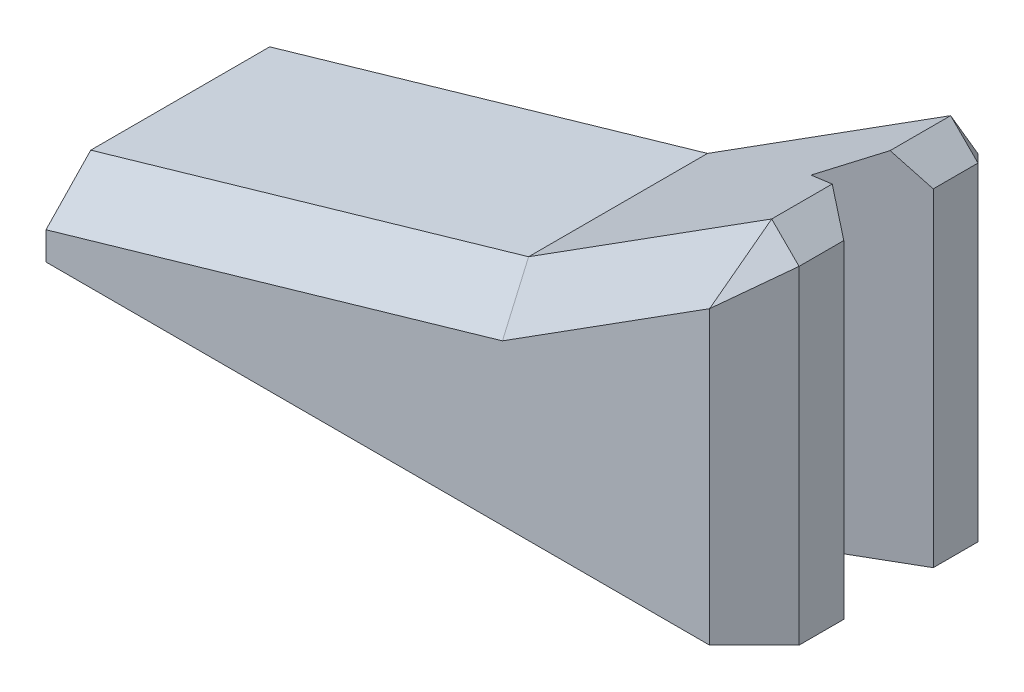
ISO-10303-21;
HEADER;
FILE_DESCRIPTION(('STEP AP214'),'2;1');
FILE_NAME('part.step','',(''),(''),'','','');
FILE_SCHEMA(('AUTOMOTIVE_DESIGN { 1 0 10303 214 1 1 1 1 }'));
ENDSEC;
DATA;
#1=APPLICATION_CONTEXT('core data for automotive mechanical design processes');
#2=APPLICATION_PROTOCOL_DEFINITION('international standard','automotive_design',2000,#1);
#3=PRODUCT_CONTEXT('',#1,'mechanical');
#4=PRODUCT('Part','Part','',(#3));
#5=PRODUCT_RELATED_PRODUCT_CATEGORY('part','',(#4));
#6=PRODUCT_DEFINITION_FORMATION('','',#4);
#7=PRODUCT_DEFINITION_CONTEXT('part definition',#1,'design');
#8=PRODUCT_DEFINITION('design','',#6,#7);
#9=PRODUCT_DEFINITION_SHAPE('','',#8);
#10=(LENGTH_UNIT() NAMED_UNIT(*) SI_UNIT(.MILLI.,.METRE.));
#11=(NAMED_UNIT(*) PLANE_ANGLE_UNIT() SI_UNIT($,.RADIAN.));
#12=(NAMED_UNIT(*) SI_UNIT($,.STERADIAN.) SOLID_ANGLE_UNIT());
#13=UNCERTAINTY_MEASURE_WITH_UNIT(LENGTH_MEASURE(1.E-05),#10,'distance_accuracy_value','');
#14=(GEOMETRIC_REPRESENTATION_CONTEXT(3) GLOBAL_UNCERTAINTY_ASSIGNED_CONTEXT((#13)) GLOBAL_UNIT_ASSIGNED_CONTEXT((#10,
#11,#12)) REPRESENTATION_CONTEXT('',''));
#15=CARTESIAN_POINT('',(0.,0.,0.));
#16=DIRECTION('',(0.,0.,1.));
#17=DIRECTION('',(1.,0.,0.));
#18=AXIS2_PLACEMENT_3D('',#15,#16,#17);
#19=CARTESIAN_POINT('',(120.65,12.7,0.));
#20=DIRECTION('',(-1.,0.,0.));
#21=DIRECTION('',(0.,0.,1.));
#22=AXIS2_PLACEMENT_3D('',#19,#20,#21);
#23=PLANE('',#22);
#24=DIRECTION('',(0.,0.,1.));
#25=VECTOR('',#24,1.);
#26=CARTESIAN_POINT('',(120.65,55.88,0.));
#27=LINE('',#26,#25);
#28=CARTESIAN_POINT('',(120.65,55.88,-38.1000000000001));
#29=VERTEX_POINT('',#28);
#30=CARTESIAN_POINT('',(120.65,55.88,-30.4800000000001));
#31=VERTEX_POINT('',#30);
#32=EDGE_CURVE('E222',#29,#31,#27,.T.);
#33=ORIENTED_EDGE('',*,*,#32,.T.);
#34=DIRECTION('',(0.,-1.,0.));
#35=VECTOR('',#34,1.);
#36=CARTESIAN_POINT('',(120.65,60.5418540549974,-30.4800000000001));
#37=LINE('',#36,#35);
#38=CARTESIAN_POINT('',(120.65,0.,-30.4800000000001));
#39=VERTEX_POINT('',#38);
#40=EDGE_CURVE('E710',#31,#39,#37,.T.);
#41=ORIENTED_EDGE('',*,*,#40,.T.);
#42=DIRECTION('',(0.,0.,-1.));
#43=VECTOR('',#42,1.);
#44=CARTESIAN_POINT('',(120.65,0.,0.));
#45=LINE('',#44,#43);
#46=CARTESIAN_POINT('',(120.65,0.,-38.1000000000001));
#47=VERTEX_POINT('',#46);
#48=EDGE_CURVE('E172',#39,#47,#45,.T.);
#49=ORIENTED_EDGE('',*,*,#48,.T.);
#50=DIRECTION('',(0.,1.,0.));
#51=VECTOR('',#50,1.);
#52=CARTESIAN_POINT('',(120.65,63.5,-38.1000000000001));
#53=LINE('',#52,#51);
#54=EDGE_CURVE('E226',#47,#29,#53,.T.);
#55=ORIENTED_EDGE('',*,*,#54,.T.);
#56=EDGE_LOOP('',(#33,#41,#49,#55));
#57=FACE_BOUND('',#56,.T.);
#58=ADVANCED_FACE('F43',(#57),#23,.F.);
#59=CARTESIAN_POINT('',(115.988145945003,60.5418540549974,-45.7200000000001));
#60=DIRECTION('',(-0.707106781186549,-0.707106781186546,0.));
#61=DIRECTION('',(0.,0.,-1.));
#62=AXIS2_PLACEMENT_3D('',#59,#60,#61);
#63=PLANE('',#62);
#64=DIRECTION('',(0.654653670707975,-0.654653670707977,-0.377964473009231));
#65=VECTOR('',#64,1.);
#66=CARTESIAN_POINT('',(120.425047139624,56.1049528603763,-30.3501234055068));
#67=LINE('',#66,#65);
#68=CARTESIAN_POINT('',(115.988145945003,60.5418540549974,-27.7884773064245));
#69=VERTEX_POINT('',#68);
#70=EDGE_CURVE('E11',#31,#69,#67,.F.);
#71=ORIENTED_EDGE('',*,*,#70,.F.);
#72=ORIENTED_EDGE('',*,*,#32,.F.);
#73=DIRECTION('',(-0.707106781186546,0.707106781186549,0.));
#74=VECTOR('',#73,1.);
#75=CARTESIAN_POINT('',(115.988145945003,60.5418540549974,-38.1000000000001));
#76=LINE('',#75,#74);
#77=CARTESIAN_POINT('',(115.988145945003,60.5418540549974,-38.1000000000001));
#78=VERTEX_POINT('',#77);
#79=EDGE_CURVE('E265',#29,#78,#76,.T.);
#80=ORIENTED_EDGE('',*,*,#79,.T.);
#81=DIRECTION('',(0.,0.,-1.));
#82=VECTOR('',#81,1.);
#83=CARTESIAN_POINT('',(115.988145945003,60.5418540549974,-45.7200000000001));
#84=LINE('',#83,#82);
#85=EDGE_CURVE('E211',#69,#78,#84,.T.);
#86=ORIENTED_EDGE('',*,*,#85,.F.);
#87=EDGE_LOOP('',(#71,#72,#80,#86));
#88=FACE_BOUND('',#87,.T.);
#89=ADVANCED_FACE('F312',(#88),#63,.F.);
#90=CARTESIAN_POINT('',(0.,12.7,-45.72));
#91=DIRECTION('',(0.,0.,-1.));
#92=DIRECTION('',(-1.,0.,0.));
#93=AXIS2_PLACEMENT_3D('',#90,#91,#92);
#94=PLANE('',#93);
#95=DIRECTION('',(0.844357144582198,0.535780750300902,0.));
#96=VECTOR('',#95,1.);
#97=CARTESIAN_POINT('',(124.732649317293,57.0659985582837,-45.72));
#98=LINE('',#97,#96);
#99=CARTESIAN_POINT('',(77.7473310303726,27.2518029345239,-45.72));
#100=VERTEX_POINT('',#99);
#101=CARTESIAN_POINT('',(113.03,49.6401666434841,-45.72));
#102=VERTEX_POINT('',#101);
#103=EDGE_CURVE('E232',#100,#102,#98,.T.);
#104=ORIENTED_EDGE('',*,*,#103,.T.);
#105=DIRECTION('',(0.,-1.,0.));
#106=VECTOR('',#105,1.);
#107=CARTESIAN_POINT('',(113.03,0.,-45.72));
#108=LINE('',#107,#106);
#109=CARTESIAN_POINT('',(113.03,0.,-45.72));
#110=VERTEX_POINT('',#109);
#111=EDGE_CURVE('E235',#102,#110,#108,.T.);
#112=ORIENTED_EDGE('',*,*,#111,.T.);
#113=DIRECTION('',(1.,0.,0.));
#114=VECTOR('',#113,1.);
#115=CARTESIAN_POINT('',(0.,0.,-45.72));
#116=LINE('',#115,#114);
#117=CARTESIAN_POINT('',(0.,0.,-45.72));
#118=VERTEX_POINT('',#117);
#119=EDGE_CURVE('E353',#118,#110,#116,.T.);
#120=ORIENTED_EDGE('',*,*,#119,.F.);
#121=DIRECTION('',(0.,-1.,0.));
#122=VECTOR('',#121,1.);
#123=CARTESIAN_POINT('',(0.,12.7,-45.72));
#124=LINE('',#123,#122);
#125=CARTESIAN_POINT('',(0.,4.7677554438384,-45.72));
#126=VERTEX_POINT('',#125);
#127=EDGE_CURVE('E205',#126,#118,#124,.T.);
#128=ORIENTED_EDGE('',*,*,#127,.F.);
#129=DIRECTION('',(0.960636040158513,0.277810004046959,0.));
#130=VECTOR('',#129,1.);
#131=CARTESIAN_POINT('',(76.7011454233083,26.9492525246055,-45.72));
#132=LINE('',#131,#130);
#133=EDGE_CURVE('E229',#126,#100,#132,.T.);
#134=ORIENTED_EDGE('',*,*,#133,.T.);
#135=EDGE_LOOP('',(#104,#112,#120,#128,#134));
#136=FACE_BOUND('',#135,.T.);
#137=ADVANCED_FACE('F407',(#136),#94,.T.);
#138=CARTESIAN_POINT('',(0.,12.7,0.));
#139=DIRECTION('',(-1.,0.,0.));
#140=DIRECTION('',(0.,0.,1.));
#141=AXIS2_PLACEMENT_3D('',#138,#139,#140);
#142=PLANE('',#141);
#143=DIRECTION('',(0.,0.,1.));
#144=VECTOR('',#143,1.);
#145=CARTESIAN_POINT('',(0.,12.7,-45.72));
#146=LINE('',#145,#144);
#147=CARTESIAN_POINT('',(0.,12.7,-38.1));
#148=VERTEX_POINT('',#147);
#149=CARTESIAN_POINT('',(0.,12.7,-7.62));
#150=VERTEX_POINT('',#149);
#151=EDGE_CURVE('E330',#148,#150,#146,.T.);
#152=ORIENTED_EDGE('',*,*,#151,.F.);
#153=DIRECTION('',(0.,-0.721158129733534,-0.692770490075343));
#154=VECTOR('',#153,1.);
#155=CARTESIAN_POINT('',(0.,31.7346484034738,-19.8146307318773));
#156=LINE('',#155,#154);
#157=EDGE_CURVE('E254',#148,#126,#156,.T.);
#158=ORIENTED_EDGE('',*,*,#157,.T.);
#159=ORIENTED_EDGE('',*,*,#127,.T.);
#160=DIRECTION('',(0.,0.,-1.));
#161=VECTOR('',#160,1.);
#162=CARTESIAN_POINT('',(0.,0.,0.));
#163=LINE('',#162,#161);
#164=CARTESIAN_POINT('',(0.,0.,0.));
#165=VERTEX_POINT('',#164);
#166=EDGE_CURVE('E371',#165,#118,#163,.T.);
#167=ORIENTED_EDGE('',*,*,#166,.F.);
#168=DIRECTION('',(0.,-1.,0.));
#169=VECTOR('',#168,1.);
#170=CARTESIAN_POINT('',(0.,12.7,0.));
#171=LINE('',#170,#169);
#172=CARTESIAN_POINT('',(0.,4.76775544383835,0.));
#173=VERTEX_POINT('',#172);
#174=EDGE_CURVE('E202',#173,#165,#171,.T.);
#175=ORIENTED_EDGE('',*,*,#174,.F.);
#176=DIRECTION('',(0.,-0.721158129733536,0.692770490075341));
#177=VECTOR('',#176,1.);
#178=CARTESIAN_POINT('',(0.,8.89307031930523,-3.96292614637549));
#179=LINE('',#178,#177);
#180=EDGE_CURVE('E251',#173,#150,#179,.F.);
#181=ORIENTED_EDGE('',*,*,#180,.T.);
#182=EDGE_LOOP('',(#152,#158,#159,#167,#175,#181));
#183=FACE_BOUND('',#182,.T.);
#184=ADVANCED_FACE('F333',(#183),#142,.T.);
#185=CARTESIAN_POINT('',(0.,12.7,0.));
#186=DIRECTION('',(0.,0.,-1.));
#187=DIRECTION('',(-1.,0.,0.));
#188=AXIS2_PLACEMENT_3D('',#185,#186,#187);
#189=PLANE('',#188);
#190=DIRECTION('',(1.,0.,0.));
#191=VECTOR('',#190,1.);
#192=CARTESIAN_POINT('',(0.,0.,0.));
#193=LINE('',#192,#191);
#194=CARTESIAN_POINT('',(113.03,0.,0.));
#195=VERTEX_POINT('',#194);
#196=EDGE_CURVE('E179',#165,#195,#193,.T.);
#197=ORIENTED_EDGE('',*,*,#196,.T.);
#198=DIRECTION('',(0.,1.,0.));
#199=VECTOR('',#198,1.);
#200=CARTESIAN_POINT('',(113.03,12.7,0.));
#201=LINE('',#200,#199);
#202=CARTESIAN_POINT('',(113.03,49.640166643484,0.));
#203=VERTEX_POINT('',#202);
#204=EDGE_CURVE('E68',#195,#203,#201,.T.);
#205=ORIENTED_EDGE('',*,*,#204,.T.);
#206=DIRECTION('',(-0.844357144582198,-0.535780750300902,0.));
#207=VECTOR('',#206,1.);
#208=CARTESIAN_POINT('',(15.7351329966423,-12.0975911027119,0.));
#209=LINE('',#208,#207);
#210=CARTESIAN_POINT('',(77.7473310303726,27.2518029345239,0.));
#211=VERTEX_POINT('',#210);
#212=EDGE_CURVE('E260',#203,#211,#209,.T.);
#213=ORIENTED_EDGE('',*,*,#212,.T.);
#214=DIRECTION('',(-0.960636040158513,-0.277810004046959,0.));
#215=VECTOR('',#214,1.);
#216=CARTESIAN_POINT('',(2.11691223083784,5.37995337399208,0.));
#217=LINE('',#216,#215);
#218=EDGE_CURVE('E257',#211,#173,#217,.T.);
#219=ORIENTED_EDGE('',*,*,#218,.T.);
#220=ORIENTED_EDGE('',*,*,#174,.T.);
#221=EDGE_LOOP('',(#197,#205,#213,#219,#220));
#222=FACE_BOUND('',#221,.T.);
#223=ADVANCED_FACE('F377',(#222),#189,.F.);
#224=CARTESIAN_POINT('',(95.25,12.7,-10.16));
#225=DIRECTION('',(0.,-1.,0.));
#226=DIRECTION('',(0.,0.,-1.));
#227=AXIS2_PLACEMENT_3D('',#224,#225,#226);
#228=CYLINDRICAL_SURFACE('',#227,1.7272);
#229=CARTESIAN_POINT('',(95.25,12.7,-10.16));
#230=DIRECTION('',(0.,1.,0.));
#231=DIRECTION('',(0.,0.,1.));
#232=AXIS2_PLACEMENT_3D('',#229,#230,#231);
#233=CIRCLE('',#232,1.7272);
#234=CARTESIAN_POINT('',(95.25,12.7,-8.43280000000002));
#235=VERTEX_POINT('',#234);
#236=EDGE_CURVE('E343',#235,#235,#233,.T.);
#237=ORIENTED_EDGE('',*,*,#236,.T.);
#238=EDGE_LOOP('',(#237));
#239=FACE_BOUND('',#238,.T.);
#240=CARTESIAN_POINT('',(95.25,0.,-10.16));
#241=DIRECTION('',(0.,1.,0.));
#242=DIRECTION('',(0.,0.,1.));
#243=AXIS2_PLACEMENT_3D('',#240,#241,#242);
#244=CIRCLE('',#243,1.7272);
#245=CARTESIAN_POINT('',(95.25,0.,-8.43280000000002));
#246=VERTEX_POINT('',#245);
#247=EDGE_CURVE('E194',#246,#246,#244,.T.);
#248=ORIENTED_EDGE('',*,*,#247,.F.);
#249=EDGE_LOOP('',(#248));
#250=FACE_BOUND('',#249,.T.);
#251=ADVANCED_FACE('F440',(#239,#250),#228,.F.);
#252=CARTESIAN_POINT('',(95.25,12.7,-35.56));
#253=DIRECTION('',(0.,-1.,0.));
#254=DIRECTION('',(0.,0.,-1.));
#255=AXIS2_PLACEMENT_3D('',#252,#253,#254);
#256=CYLINDRICAL_SURFACE('',#255,1.7272);
#257=CARTESIAN_POINT('',(95.25,12.7,-35.56));
#258=DIRECTION('',(0.,1.,0.));
#259=DIRECTION('',(0.,0.,1.));
#260=AXIS2_PLACEMENT_3D('',#257,#258,#259);
#261=CIRCLE('',#260,1.7272);
#262=CARTESIAN_POINT('',(95.25,12.7,-33.8328));
#263=VERTEX_POINT('',#262);
#264=EDGE_CURVE('E362',#263,#263,#261,.T.);
#265=ORIENTED_EDGE('',*,*,#264,.T.);
#266=EDGE_LOOP('',(#265));
#267=FACE_BOUND('',#266,.T.);
#268=CARTESIAN_POINT('',(95.25,0.,-35.56));
#269=DIRECTION('',(0.,1.,0.));
#270=DIRECTION('',(0.,0.,1.));
#271=AXIS2_PLACEMENT_3D('',#268,#269,#270);
#272=CIRCLE('',#271,1.7272);
#273=CARTESIAN_POINT('',(95.25,0.,-33.8328));
#274=VERTEX_POINT('',#273);
#275=EDGE_CURVE('E190',#274,#274,#272,.T.);
#276=ORIENTED_EDGE('',*,*,#275,.F.);
#277=EDGE_LOOP('',(#276));
#278=FACE_BOUND('',#277,.T.);
#279=ADVANCED_FACE('F436',(#267,#278),#256,.F.);
#280=CARTESIAN_POINT('',(57.15,12.7,-35.56));
#281=DIRECTION('',(0.,-1.,0.));
#282=DIRECTION('',(0.,0.,-1.));
#283=AXIS2_PLACEMENT_3D('',#280,#281,#282);
#284=CYLINDRICAL_SURFACE('',#283,1.7272);
#285=CARTESIAN_POINT('',(57.15,12.7,-35.56));
#286=DIRECTION('',(0.,1.,0.));
#287=DIRECTION('',(0.,0.,1.));
#288=AXIS2_PLACEMENT_3D('',#285,#286,#287);
#289=CIRCLE('',#288,1.7272);
#290=CARTESIAN_POINT('',(57.15,12.7,-33.8328));
#291=VERTEX_POINT('',#290);
#292=EDGE_CURVE('E358',#291,#291,#289,.T.);
#293=ORIENTED_EDGE('',*,*,#292,.T.);
#294=EDGE_LOOP('',(#293));
#295=FACE_BOUND('',#294,.T.);
#296=CARTESIAN_POINT('',(57.15,0.,-35.56));
#297=DIRECTION('',(0.,1.,0.));
#298=DIRECTION('',(0.,0.,1.));
#299=AXIS2_PLACEMENT_3D('',#296,#297,#298);
#300=CIRCLE('',#299,1.7272);
#301=CARTESIAN_POINT('',(57.15,0.,-33.8328));
#302=VERTEX_POINT('',#301);
#303=EDGE_CURVE('E186',#302,#302,#300,.T.);
#304=ORIENTED_EDGE('',*,*,#303,.F.);
#305=EDGE_LOOP('',(#304));
#306=FACE_BOUND('',#305,.T.);
#307=ADVANCED_FACE('F429',(#295,#306),#284,.F.);
#308=CARTESIAN_POINT('',(19.05,12.7,-10.16));
#309=DIRECTION('',(0.,-1.,0.));
#310=DIRECTION('',(0.,0.,-1.));
#311=AXIS2_PLACEMENT_3D('',#308,#309,#310);
#312=CYLINDRICAL_SURFACE('',#311,1.7272);
#313=CARTESIAN_POINT('',(19.05,12.7,-10.16));
#314=DIRECTION('',(0.,1.,0.));
#315=DIRECTION('',(0.,0.,1.));
#316=AXIS2_PLACEMENT_3D('',#313,#314,#315);
#317=CIRCLE('',#316,1.7272);
#318=CARTESIAN_POINT('',(19.05,12.7,-8.43280000000001));
#319=VERTEX_POINT('',#318);
#320=EDGE_CURVE('E354',#319,#319,#317,.T.);
#321=ORIENTED_EDGE('',*,*,#320,.T.);
#322=EDGE_LOOP('',(#321));
#323=FACE_BOUND('',#322,.T.);
#324=CARTESIAN_POINT('',(19.05,0.,-10.16));
#325=DIRECTION('',(0.,1.,0.));
#326=DIRECTION('',(0.,0.,1.));
#327=AXIS2_PLACEMENT_3D('',#324,#325,#326);
#328=CIRCLE('',#327,1.7272);
#329=CARTESIAN_POINT('',(19.05,0.,-8.43280000000001));
#330=VERTEX_POINT('',#329);
#331=EDGE_CURVE('E177',#330,#330,#328,.T.);
#332=ORIENTED_EDGE('',*,*,#331,.F.);
#333=EDGE_LOOP('',(#332));
#334=FACE_BOUND('',#333,.T.);
#335=ADVANCED_FACE('F424',(#323,#334),#312,.F.);
#336=CARTESIAN_POINT('',(19.05,12.7,-35.56));
#337=DIRECTION('',(0.,-1.,0.));
#338=DIRECTION('',(0.,0.,-1.));
#339=AXIS2_PLACEMENT_3D('',#336,#337,#338);
#340=CYLINDRICAL_SURFACE('',#339,1.7272);
#341=CARTESIAN_POINT('',(19.05,12.7,-35.56));
#342=DIRECTION('',(0.,1.,0.));
#343=DIRECTION('',(0.,0.,1.));
#344=AXIS2_PLACEMENT_3D('',#341,#342,#343);
#345=CIRCLE('',#344,1.7272);
#346=CARTESIAN_POINT('',(19.05,12.7,-33.8328));
#347=VERTEX_POINT('',#346);
#348=EDGE_CURVE('E349',#347,#347,#345,.T.);
#349=ORIENTED_EDGE('',*,*,#348,.T.);
#350=EDGE_LOOP('',(#349));
#351=FACE_BOUND('',#350,.T.);
#352=CARTESIAN_POINT('',(19.05,0.,-35.56));
#353=DIRECTION('',(0.,1.,0.));
#354=DIRECTION('',(0.,0.,1.));
#355=AXIS2_PLACEMENT_3D('',#352,#353,#354);
#356=CIRCLE('',#355,1.7272);
#357=CARTESIAN_POINT('',(19.05,0.,-33.8328));
#358=VERTEX_POINT('',#357);
#359=EDGE_CURVE('E171',#358,#358,#356,.T.);
#360=ORIENTED_EDGE('',*,*,#359,.F.);
#361=EDGE_LOOP('',(#360));
#362=FACE_BOUND('',#361,.T.);
#363=ADVANCED_FACE('F417',(#351,#362),#340,.F.);
#364=CARTESIAN_POINT('',(120.65,0.,-7.62));
#365=VERTEX_POINT('',#364);
#366=CARTESIAN_POINT('',(120.65,0.,-15.2400000000001));
#367=VERTEX_POINT('',#366);
#368=EDGE_CURVE('E163',#365,#367,#45,.T.);
#369=ORIENTED_EDGE('',*,*,#368,.T.);
#370=DIRECTION('',(0.,-1.,0.));
#371=VECTOR('',#370,1.);
#372=CARTESIAN_POINT('',(120.65,60.5418540549974,-15.2400000000001));
#373=LINE('',#372,#371);
#374=CARTESIAN_POINT('',(120.65,55.88,-15.2400000000001));
#375=VERTEX_POINT('',#374);
#376=EDGE_CURVE('E146',#375,#367,#373,.T.);
#377=ORIENTED_EDGE('',*,*,#376,.F.);
#378=CARTESIAN_POINT('',(120.65,55.88,-7.62));
#379=VERTEX_POINT('',#378);
#380=EDGE_CURVE('E221',#375,#379,#27,.T.);
#381=ORIENTED_EDGE('',*,*,#380,.T.);
#382=DIRECTION('',(0.,-1.,0.));
#383=VECTOR('',#382,1.);
#384=CARTESIAN_POINT('',(120.65,12.7,-7.62));
#385=LINE('',#384,#383);
#386=EDGE_CURVE('E169',#379,#365,#385,.T.);
#387=ORIENTED_EDGE('',*,*,#386,.T.);
#388=EDGE_LOOP('',(#369,#377,#381,#387));
#389=FACE_BOUND('',#388,.T.);
#390=ADVANCED_FACE('F167',(#389),#23,.F.);
#391=CARTESIAN_POINT('',(57.15,12.7,-10.16));
#392=DIRECTION('',(0.,-1.,0.));
#393=DIRECTION('',(0.,0.,-1.));
#394=AXIS2_PLACEMENT_3D('',#391,#392,#393);
#395=CYLINDRICAL_SURFACE('',#394,1.7272);
#396=CARTESIAN_POINT('',(57.15,12.7,-10.16));
#397=DIRECTION('',(0.,1.,0.));
#398=DIRECTION('',(0.,0.,1.));
#399=AXIS2_PLACEMENT_3D('',#396,#397,#398);
#400=CIRCLE('',#399,1.7272);
#401=CARTESIAN_POINT('',(57.15,12.7,-8.43280000000001));
#402=VERTEX_POINT('',#401);
#403=EDGE_CURVE('E338',#402,#402,#400,.T.);
#404=ORIENTED_EDGE('',*,*,#403,.T.);
#405=EDGE_LOOP('',(#404));
#406=FACE_BOUND('',#405,.T.);
#407=CARTESIAN_POINT('',(57.15,0.,-10.16));
#408=DIRECTION('',(0.,1.,0.));
#409=DIRECTION('',(0.,0.,1.));
#410=AXIS2_PLACEMENT_3D('',#407,#408,#409);
#411=CIRCLE('',#410,1.7272);
#412=CARTESIAN_POINT('',(57.15,0.,-8.43280000000001));
#413=VERTEX_POINT('',#412);
#414=EDGE_CURVE('E198',#413,#413,#411,.T.);
#415=ORIENTED_EDGE('',*,*,#414,.F.);
#416=EDGE_LOOP('',(#415));
#417=FACE_BOUND('',#416,.T.);
#418=ADVANCED_FACE('F416',(#406,#417),#395,.F.);
#419=CARTESIAN_POINT('',(0.,0.,0.));
#420=DIRECTION('',(0.,1.,0.));
#421=DIRECTION('',(0.,0.,1.));
#422=AXIS2_PLACEMENT_3D('',#419,#420,#421);
#423=PLANE('',#422);
#424=ORIENTED_EDGE('',*,*,#48,.F.);
#425=DIRECTION('',(0.866025403784436,0.,-0.500000000000005));
#426=VECTOR('',#425,1.);
#427=CARTESIAN_POINT('',(16.9642728463257,0.,29.3829824832967));
#428=LINE('',#427,#426);
#429=CARTESIAN_POINT('',(107.451772846325,0.,-22.86));
#430=VERTEX_POINT('',#429);
#431=EDGE_CURVE('E156',#430,#39,#428,.T.);
#432=ORIENTED_EDGE('',*,*,#431,.F.);
#433=DIRECTION('',(-0.866025403784438,0.,-0.500000000000002));
#434=VECTOR('',#433,1.);
#435=CARTESIAN_POINT('',(36.7616135768377,0.,-63.6729824832964));
#436=LINE('',#435,#434);
#437=EDGE_CURVE('E149',#367,#430,#436,.T.);
#438=ORIENTED_EDGE('',*,*,#437,.F.);
#439=ORIENTED_EDGE('',*,*,#368,.F.);
#440=DIRECTION('',(0.707106781186549,0.,-0.707106781186546));
#441=VECTOR('',#440,1.);
#442=CARTESIAN_POINT('',(120.65,0.,-7.62));
#443=LINE('',#442,#441);
#444=EDGE_CURVE('E238',#365,#195,#443,.F.);
#445=ORIENTED_EDGE('',*,*,#444,.T.);
#446=ORIENTED_EDGE('',*,*,#196,.F.);
#447=ORIENTED_EDGE('',*,*,#166,.T.);
#448=ORIENTED_EDGE('',*,*,#119,.T.);
#449=DIRECTION('',(0.707106781186547,0.,0.707106781186548));
#450=VECTOR('',#449,1.);
#451=CARTESIAN_POINT('',(113.03,0.,-45.72));
#452=LINE('',#451,#450);
#453=EDGE_CURVE('E241',#110,#47,#452,.T.);
#454=ORIENTED_EDGE('',*,*,#453,.T.);
#455=EDGE_LOOP('',(#424,#432,#438,#439,#445,#446,#447,#448,#454));
#456=FACE_BOUND('',#455,.T.);
#457=ORIENTED_EDGE('',*,*,#359,.T.);
#458=EDGE_LOOP('',(#457));
#459=FACE_BOUND('',#458,.T.);
#460=ORIENTED_EDGE('',*,*,#331,.T.);
#461=EDGE_LOOP('',(#460));
#462=FACE_BOUND('',#461,.T.);
#463=ORIENTED_EDGE('',*,*,#303,.T.);
#464=EDGE_LOOP('',(#463));
#465=FACE_BOUND('',#464,.T.);
#466=ORIENTED_EDGE('',*,*,#275,.T.);
#467=EDGE_LOOP('',(#466));
#468=FACE_BOUND('',#467,.T.);
#469=ORIENTED_EDGE('',*,*,#247,.T.);
#470=EDGE_LOOP('',(#469));
#471=FACE_BOUND('',#470,.T.);
#472=ORIENTED_EDGE('',*,*,#414,.T.);
#473=EDGE_LOOP('',(#472));
#474=FACE_BOUND('',#473,.T.);
#475=ADVANCED_FACE('F161',(#456,#459,#462,#465,#468,#471,#474),#423,.F.);
#476=CARTESIAN_POINT('',(0.,12.7,0.));
#477=DIRECTION('',(0.,-1.,0.));
#478=DIRECTION('',(0.,0.,-1.));
#479=AXIS2_PLACEMENT_3D('',#476,#477,#478);
#480=PLANE('',#479);
#481=ORIENTED_EDGE('',*,*,#403,.F.);
#482=EDGE_LOOP('',(#481));
#483=FACE_BOUND('',#482,.T.);
#484=ADVANCED_FACE('F447',(#483),#480,.T.);
#485=ORIENTED_EDGE('',*,*,#236,.F.);
#486=EDGE_LOOP('',(#485));
#487=FACE_BOUND('',#486,.T.);
#488=ADVANCED_FACE('F626',(#487),#480,.T.);
#489=ORIENTED_EDGE('',*,*,#264,.F.);
#490=EDGE_LOOP('',(#489));
#491=FACE_BOUND('',#490,.T.);
#492=ADVANCED_FACE('F617',(#491),#480,.T.);
#493=ORIENTED_EDGE('',*,*,#292,.F.);
#494=EDGE_LOOP('',(#493));
#495=FACE_BOUND('',#494,.T.);
#496=ADVANCED_FACE('F608',(#495),#480,.T.);
#497=ORIENTED_EDGE('',*,*,#320,.F.);
#498=EDGE_LOOP('',(#497));
#499=FACE_BOUND('',#498,.T.);
#500=ADVANCED_FACE('F451',(#499),#480,.T.);
#501=ORIENTED_EDGE('',*,*,#348,.F.);
#502=EDGE_LOOP('',(#501));
#503=FACE_BOUND('',#502,.T.);
#504=ADVANCED_FACE('F448',(#503),#480,.T.);
#505=CARTESIAN_POINT('',(-3.38930363799196,11.7198343409731,-45.72));
#506=DIRECTION('',(0.277810004046959,-0.960636040158513,0.));
#507=DIRECTION('',(0.960636040158513,0.277810004046959,0.));
#508=AXIS2_PLACEMENT_3D('',#505,#506,#507);
#509=PLANE('',#508);
#510=DIRECTION('',(0.,0.,1.));
#511=VECTOR('',#510,1.);
#512=CARTESIAN_POINT('',(74.5842331924705,34.2692991506133,-45.72));
#513=LINE('',#512,#511);
#514=CARTESIAN_POINT('',(74.5842331924705,34.2692991506133,-38.1));
#515=VERTEX_POINT('',#514);
#516=CARTESIAN_POINT('',(74.5842331924705,34.2692991506133,-7.62));
#517=VERTEX_POINT('',#516);
#518=EDGE_CURVE('E297',#515,#517,#513,.T.);
#519=ORIENTED_EDGE('',*,*,#518,.F.);
#520=DIRECTION('',(-0.960636040158513,-0.277810004046959,0.));
#521=VECTOR('',#520,1.);
#522=CARTESIAN_POINT('',(0.,12.7,-38.1));
#523=LINE('',#522,#521);
#524=EDGE_CURVE('E248',#515,#148,#523,.T.);
#525=ORIENTED_EDGE('',*,*,#524,.T.);
#526=ORIENTED_EDGE('',*,*,#151,.T.);
#527=DIRECTION('',(0.960636040158513,0.277810004046959,0.));
#528=VECTOR('',#527,1.);
#529=CARTESIAN_POINT('',(-3.38930363799196,11.7198343409731,-7.62));
#530=LINE('',#529,#528);
#531=EDGE_CURVE('E245',#150,#517,#530,.T.);
#532=ORIENTED_EDGE('',*,*,#531,.T.);
#533=EDGE_LOOP('',(#519,#525,#526,#532));
#534=FACE_BOUND('',#533,.T.);
#535=ADVANCED_FACE('F329',(#534),#509,.F.);
#536=CARTESIAN_POINT('',(5.90712681288293,-9.30926451838665,-45.72));
#537=DIRECTION('',(0.535780750300902,-0.844357144582198,0.));
#538=DIRECTION('',(0.844357144582198,0.535780750300902,0.));
#539=AXIS2_PLACEMENT_3D('',#536,#537,#538);
#540=PLANE('',#539);
#541=DIRECTION('',(-0.758975756133978,-0.481602604645303,-0.438194857112354));
#542=VECTOR('',#541,1.);
#543=CARTESIAN_POINT('',(17.8024327072077,-1.76118375894253,-74.6190706619922));
#544=LINE('',#543,#542);
#545=CARTESIAN_POINT('',(115.988145945003,60.5418540549974,-17.9315226935756));
#546=VERTEX_POINT('',#545);
#547=CARTESIAN_POINT('',(107.451772846325,55.1251599309477,-22.86));
#548=VERTEX_POINT('',#547);
#549=EDGE_CURVE('E60',#546,#548,#544,.T.);
#550=ORIENTED_EDGE('',*,*,#549,.T.);
#551=DIRECTION('',(0.758975756133976,0.481602604645303,-0.438194857112357));
#552=VECTOR('',#551,1.);
#553=CARTESIAN_POINT('',(33.0079570692649,7.88737230965434,20.1201570783893));
#554=LINE('',#553,#552);
#555=EDGE_CURVE('E270',#548,#69,#554,.T.);
#556=ORIENTED_EDGE('',*,*,#555,.T.);
#557=ORIENTED_EDGE('',*,*,#85,.T.);
#558=DIRECTION('',(-0.844357144582198,-0.535780750300902,0.));
#559=VECTOR('',#558,1.);
#560=CARTESIAN_POINT('',(74.5842331924705,34.2692991506133,-38.1));
#561=LINE('',#560,#559);
#562=EDGE_CURVE('E216',#78,#515,#561,.T.);
#563=ORIENTED_EDGE('',*,*,#562,.T.);
#564=ORIENTED_EDGE('',*,*,#518,.T.);
#565=DIRECTION('',(0.844357144582198,0.535780750300902,0.));
#566=VECTOR('',#565,1.);
#567=CARTESIAN_POINT('',(5.90712681288293,-9.30926451838665,-7.62));
#568=LINE('',#567,#566);
#569=CARTESIAN_POINT('',(115.988145945003,60.5418540549974,-7.62));
#570=VERTEX_POINT('',#569);
#571=EDGE_CURVE('E208',#517,#570,#568,.T.);
#572=ORIENTED_EDGE('',*,*,#571,.T.);
#573=EDGE_CURVE('E212',#570,#546,#84,.T.);
#574=ORIENTED_EDGE('',*,*,#573,.T.);
#575=EDGE_LOOP('',(#550,#556,#557,#563,#564,#572,#574));
#576=FACE_BOUND('',#575,.T.);
#577=ADVANCED_FACE('F304',(#576),#540,.F.);
#578=CARTESIAN_POINT('',(-3.38930363799196,11.7198343409731,-7.62));
#579=DIRECTION('',(0.196441337743067,-0.679272258248276,-0.707106781186549));
#580=DIRECTION('',(0.960636040158513,0.277810004046959,0.));
#581=AXIS2_PLACEMENT_3D('',#578,#579,#580);
#582=PLANE('',#581);
#583=ORIENTED_EDGE('',*,*,#180,.F.);
#584=ORIENTED_EDGE('',*,*,#218,.F.);
#585=DIRECTION('',(-0.292035835719711,0.647896611849595,-0.703523312342459));
#586=VECTOR('',#585,1.);
#587=CARTESIAN_POINT('',(76.9725687226027,28.9706532014983,-1.86642623394866));
#588=LINE('',#587,#586);
#589=EDGE_CURVE('E294',#517,#211,#588,.F.);
#590=ORIENTED_EDGE('',*,*,#589,.F.);
#591=ORIENTED_EDGE('',*,*,#531,.F.);
#592=EDGE_LOOP('',(#583,#584,#590,#591));
#593=FACE_BOUND('',#592,.T.);
#594=ADVANCED_FACE('F46',(#593),#582,.F.);
#595=CARTESIAN_POINT('',(2.11691223083781,5.37995337399214,-45.72));
#596=DIRECTION('',(-0.196441337743068,0.679272258248278,-0.707106781186547));
#597=DIRECTION('',(-0.960636040158513,-0.277810004046959,0.));
#598=AXIS2_PLACEMENT_3D('',#595,#596,#597);
#599=PLANE('',#598);
#600=ORIENTED_EDGE('',*,*,#157,.F.);
#601=ORIENTED_EDGE('',*,*,#524,.F.);
#602=DIRECTION('',(0.292035835719709,-0.647896611849593,-0.703523312342461));
#603=VECTOR('',#602,1.);
#604=CARTESIAN_POINT('',(79.9038857204749,22.4673747716506,-50.9152065919903));
#605=LINE('',#604,#603);
#606=EDGE_CURVE('E290',#100,#515,#605,.F.);
#607=ORIENTED_EDGE('',*,*,#606,.F.);
#608=ORIENTED_EDGE('',*,*,#133,.F.);
#609=EDGE_LOOP('',(#600,#601,#607,#608));
#610=FACE_BOUND('',#609,.T.);
#611=ADVANCED_FACE('F325',(#610),#599,.T.);
#612=CARTESIAN_POINT('',(120.65,12.7,-7.62));
#613=DIRECTION('',(-0.707106781186546,0.,-0.707106781186549));
#614=DIRECTION('',(0.,-1.,0.));
#615=AXIS2_PLACEMENT_3D('',#612,#613,#614);
#616=PLANE('',#615);
#617=ORIENTED_EDGE('',*,*,#444,.F.);
#618=ORIENTED_EDGE('',*,*,#386,.F.);
#619=DIRECTION('',(-0.611926176354942,-0.50109151797176,0.61192617635494));
#620=VECTOR('',#619,1.);
#621=CARTESIAN_POINT('',(120.65,55.88,-7.62));
#622=LINE('',#621,#620);
#623=EDGE_CURVE('E286',#203,#379,#622,.F.);
#624=ORIENTED_EDGE('',*,*,#623,.F.);
#625=ORIENTED_EDGE('',*,*,#204,.F.);
#626=EDGE_LOOP('',(#617,#618,#624,#625));
#627=FACE_BOUND('',#626,.T.);
#628=ADVANCED_FACE('F380',(#627),#616,.F.);
#629=CARTESIAN_POINT('',(5.90712681288293,-9.30926451838665,-7.62));
#630=DIRECTION('',(0.378854201766984,-0.597050662677381,-0.707106781186549));
#631=DIRECTION('',(0.844357144582198,0.535780750300902,0.));
#632=AXIS2_PLACEMENT_3D('',#629,#630,#631);
#633=PLANE('',#632);
#634=ORIENTED_EDGE('',*,*,#589,.T.);
#635=ORIENTED_EDGE('',*,*,#212,.F.);
#636=DIRECTION('',(0.217099238421393,0.800078183615629,-0.559234137709033));
#637=VECTOR('',#636,1.);
#638=CARTESIAN_POINT('',(115.398121719676,58.3674313627729,-6.10013428661955));
#639=LINE('',#638,#637);
#640=EDGE_CURVE('E282',#570,#203,#639,.F.);
#641=ORIENTED_EDGE('',*,*,#640,.F.);
#642=ORIENTED_EDGE('',*,*,#571,.F.);
#643=EDGE_LOOP('',(#634,#635,#641,#642));
#644=FACE_BOUND('',#643,.T.);
#645=ADVANCED_FACE('F388',(#644),#633,.F.);
#646=CARTESIAN_POINT('',(15.7351329966422,-12.0975911027119,-45.72));
#647=DIRECTION('',(-0.378854201766985,0.597050662677383,-0.707106781186547));
#648=DIRECTION('',(-0.844357144582198,-0.535780750300902,0.));
#649=AXIS2_PLACEMENT_3D('',#646,#647,#648);
#650=PLANE('',#649);
#651=ORIENTED_EDGE('',*,*,#606,.T.);
#652=ORIENTED_EDGE('',*,*,#562,.F.);
#653=DIRECTION('',(0.217099238421391,0.800078183615628,0.559234137709037));
#654=VECTOR('',#653,1.);
#655=CARTESIAN_POINT('',(115.988145945003,60.5418540549974,-38.1000000000001));
#656=LINE('',#655,#654);
#657=EDGE_CURVE('E278',#102,#78,#656,.T.);
#658=ORIENTED_EDGE('',*,*,#657,.F.);
#659=ORIENTED_EDGE('',*,*,#103,.F.);
#660=EDGE_LOOP('',(#651,#652,#658,#659));
#661=FACE_BOUND('',#660,.T.);
#662=ADVANCED_FACE('F319',(#661),#650,.T.);
#663=CARTESIAN_POINT('',(113.03,12.7,-45.72));
#664=DIRECTION('',(0.707106781186548,0.,-0.707106781186547));
#665=DIRECTION('',(0.,1.,0.));
#666=AXIS2_PLACEMENT_3D('',#663,#664,#665);
#667=PLANE('',#666);
#668=ORIENTED_EDGE('',*,*,#453,.F.);
#669=ORIENTED_EDGE('',*,*,#111,.F.);
#670=DIRECTION('',(-0.611926176354943,-0.501091517971755,-0.611926176354944));
#671=VECTOR('',#670,1.);
#672=CARTESIAN_POINT('',(120.333820803318,55.6210885173108,-38.4161791966818));
#673=LINE('',#672,#671);
#674=EDGE_CURVE('E274',#29,#102,#673,.T.);
#675=ORIENTED_EDGE('',*,*,#674,.F.);
#676=ORIENTED_EDGE('',*,*,#54,.F.);
#677=EDGE_LOOP('',(#668,#669,#675,#676));
#678=FACE_BOUND('',#677,.T.);
#679=ADVANCED_FACE('F520',(#678),#667,.T.);
#680=CARTESIAN_POINT('',(120.65,55.88,-7.62));
#681=DIRECTION('',(0.434032149607534,0.434032149607533,0.789450559702207));
#682=DIRECTION('',(0.87629354393973,0.,-0.481777567814804));
#683=AXIS2_PLACEMENT_3D('',#680,#681,#682);
#684=PLANE('',#683);
#685=ORIENTED_EDGE('',*,*,#640,.T.);
#686=ORIENTED_EDGE('',*,*,#623,.T.);
#687=DIRECTION('',(0.707106781186546,-0.707106781186549,0.));
#688=VECTOR('',#687,1.);
#689=CARTESIAN_POINT('',(120.65,55.88,-7.62));
#690=LINE('',#689,#688);
#691=EDGE_CURVE('E269',#570,#379,#690,.T.);
#692=ORIENTED_EDGE('',*,*,#691,.F.);
#693=EDGE_LOOP('',(#685,#686,#692));
#694=FACE_BOUND('',#693,.T.);
#695=ADVANCED_FACE('F384',(#694),#684,.T.);
#696=CARTESIAN_POINT('',(115.988145945003,60.5418540549974,-38.1000000000001));
#697=DIRECTION('',(0.434032149607536,0.434032149607535,-0.789450559702204));
#698=DIRECTION('',(-0.876293543939728,0.,-0.481777567814808));
#699=AXIS2_PLACEMENT_3D('',#696,#697,#698);
#700=PLANE('',#699);
#701=ORIENTED_EDGE('',*,*,#674,.T.);
#702=ORIENTED_EDGE('',*,*,#657,.T.);
#703=ORIENTED_EDGE('',*,*,#79,.F.);
#704=EDGE_LOOP('',(#701,#702,#703));
#705=FACE_BOUND('',#704,.T.);
#706=ADVANCED_FACE('F315',(#705),#700,.T.);
#707=DIRECTION('',(-0.654653670707976,0.654653670707978,-0.377964473009228));
#708=VECTOR('',#707,1.);
#709=CARTESIAN_POINT('',(109.112281007902,67.4177189920977,-21.901305165922));
#710=LINE('',#709,#708);
#711=EDGE_CURVE('E53',#546,#375,#710,.F.);
#712=ORIENTED_EDGE('',*,*,#711,.F.);
#713=ORIENTED_EDGE('',*,*,#573,.F.);
#714=ORIENTED_EDGE('',*,*,#691,.T.);
#715=ORIENTED_EDGE('',*,*,#380,.F.);
#716=EDGE_LOOP('',(#712,#713,#714,#715));
#717=FACE_BOUND('',#716,.T.);
#718=ADVANCED_FACE('F393',(#717),#63,.F.);
#719=CARTESIAN_POINT('',(16.9642728463257,60.5418540549974,29.3829824832967));
#720=DIRECTION('',(-0.500000000000005,0.,-0.866025403784436));
#721=DIRECTION('',(-0.866025403784436,0.,0.500000000000005));
#722=AXIS2_PLACEMENT_3D('',#719,#720,#721);
#723=PLANE('',#722);
#724=DIRECTION('',(0.,-1.,0.));
#725=VECTOR('',#724,1.);
#726=CARTESIAN_POINT('',(107.451772846325,60.5418540549974,-22.86));
#727=LINE('',#726,#725);
#728=EDGE_CURVE('E155',#548,#430,#727,.T.);
#729=ORIENTED_EDGE('',*,*,#728,.T.);
#730=ORIENTED_EDGE('',*,*,#431,.T.);
#731=ORIENTED_EDGE('',*,*,#40,.F.);
#732=ORIENTED_EDGE('',*,*,#70,.T.);
#733=ORIENTED_EDGE('',*,*,#555,.F.);
#734=EDGE_LOOP('',(#729,#730,#731,#732,#733));
#735=FACE_BOUND('',#734,.T.);
#736=ADVANCED_FACE('F395',(#735),#723,.F.);
#737=CARTESIAN_POINT('',(36.7616135768377,60.5418540549974,-63.6729824832964));
#738=DIRECTION('',(-0.500000000000002,0.,0.866025403784438));
#739=DIRECTION('',(0.866025403784438,0.,0.500000000000002));
#740=AXIS2_PLACEMENT_3D('',#737,#738,#739);
#741=PLANE('',#740);
#742=ORIENTED_EDGE('',*,*,#711,.T.);
#743=ORIENTED_EDGE('',*,*,#376,.T.);
#744=ORIENTED_EDGE('',*,*,#437,.T.);
#745=ORIENTED_EDGE('',*,*,#728,.F.);
#746=ORIENTED_EDGE('',*,*,#549,.F.);
#747=EDGE_LOOP('',(#742,#743,#744,#745,#746));
#748=FACE_BOUND('',#747,.T.);
#749=ADVANCED_FACE('F148',(#748),#741,.F.);
#750=CLOSED_SHELL('',(#58,#89,#137,#184,#223,#251,#279,#307,#335,#363,#390,#418,#475,#484,#488,
#492,#496,#500,#504,#535,#577,#594,#611,#628,#645,#662,#679,#695,#706,#718,#736,#749));
#751=MANIFOLD_SOLID_BREP('B2',#750);
#752=ADVANCED_BREP_SHAPE_REPRESENTATION('',(#18,#751),#14);
#753=SHAPE_DEFINITION_REPRESENTATION(#9,#752);
ENDSEC;
END-ISO-10303-21;
